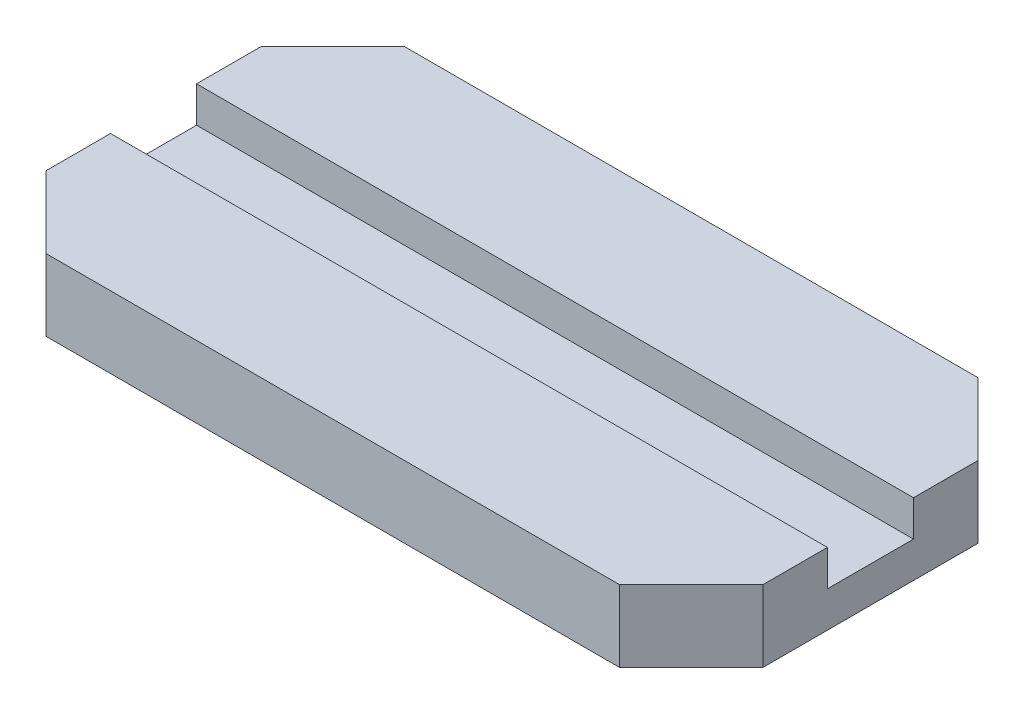
ISO-10303-21;
HEADER;
FILE_DESCRIPTION(('STEP AP214'),'2;1');
FILE_NAME('part.step','',(''),(''),'','','');
FILE_SCHEMA(('AUTOMOTIVE_DESIGN { 1 0 10303 214 1 1 1 1 }'));
ENDSEC;
DATA;
#1=APPLICATION_CONTEXT('core data for automotive mechanical design processes');
#2=APPLICATION_PROTOCOL_DEFINITION('international standard','automotive_design',2000,#1);
#3=PRODUCT_CONTEXT('',#1,'mechanical');
#4=PRODUCT('Part','Part','',(#3));
#5=PRODUCT_RELATED_PRODUCT_CATEGORY('part','',(#4));
#6=PRODUCT_DEFINITION_FORMATION('','',#4);
#7=PRODUCT_DEFINITION_CONTEXT('part definition',#1,'design');
#8=PRODUCT_DEFINITION('design','',#6,#7);
#9=PRODUCT_DEFINITION_SHAPE('','',#8);
#10=(LENGTH_UNIT() NAMED_UNIT(*) SI_UNIT(.MILLI.,.METRE.));
#11=(NAMED_UNIT(*) PLANE_ANGLE_UNIT() SI_UNIT($,.RADIAN.));
#12=(NAMED_UNIT(*) SI_UNIT($,.STERADIAN.) SOLID_ANGLE_UNIT());
#13=UNCERTAINTY_MEASURE_WITH_UNIT(LENGTH_MEASURE(1.E-05),#10,'distance_accuracy_value','');
#14=(GEOMETRIC_REPRESENTATION_CONTEXT(3) GLOBAL_UNCERTAINTY_ASSIGNED_CONTEXT((#13)) GLOBAL_UNIT_ASSIGNED_CONTEXT((#10,
#11,#12)) REPRESENTATION_CONTEXT('',''));
#15=CARTESIAN_POINT('',(0.,0.,0.));
#16=DIRECTION('',(0.,0.,1.));
#17=DIRECTION('',(1.,0.,0.));
#18=AXIS2_PLACEMENT_3D('',#15,#16,#17);
#19=CARTESIAN_POINT('',(0.,10.,0.));
#20=DIRECTION('',(0.,1.,0.));
#21=DIRECTION('',(0.,0.,1.));
#22=AXIS2_PLACEMENT_3D('',#19,#20,#21);
#23=PLANE('',#22);
#24=DIRECTION('',(-1.,0.,0.));
#25=VECTOR('',#24,1.);
#26=CARTESIAN_POINT('',(0.,10.,-6.));
#27=LINE('',#26,#25);
#28=CARTESIAN_POINT('',(50.,10.,-6.));
#29=VERTEX_POINT('',#28);
#30=CARTESIAN_POINT('',(-50.,10.,-6.));
#31=VERTEX_POINT('',#30);
#32=EDGE_CURVE('E54',#29,#31,#27,.T.);
#33=ORIENTED_EDGE('',*,*,#32,.F.);
#34=DIRECTION('',(0.,0.,-1.));
#35=VECTOR('',#34,1.);
#36=CARTESIAN_POINT('',(50.,10.,-25.));
#37=LINE('',#36,#35);
#38=CARTESIAN_POINT('',(50.,10.,-15.));
#39=VERTEX_POINT('',#38);
#40=EDGE_CURVE('E69',#29,#39,#37,.T.);
#41=ORIENTED_EDGE('',*,*,#40,.T.);
#42=DIRECTION('',(0.707106781186547,0.,0.707106781186549));
#43=VECTOR('',#42,1.);
#44=CARTESIAN_POINT('',(32.5,10.,-32.5));
#45=LINE('',#44,#43);
#46=CARTESIAN_POINT('',(40.,10.,-25.));
#47=VERTEX_POINT('',#46);
#48=EDGE_CURVE('E199',#39,#47,#45,.F.);
#49=ORIENTED_EDGE('',*,*,#48,.T.);
#50=DIRECTION('',(-1.,0.,0.));
#51=VECTOR('',#50,1.);
#52=CARTESIAN_POINT('',(-50.,10.,-25.));
#53=LINE('',#52,#51);
#54=CARTESIAN_POINT('',(-40.,10.,-25.));
#55=VERTEX_POINT('',#54);
#56=EDGE_CURVE('E157',#47,#55,#53,.T.);
#57=ORIENTED_EDGE('',*,*,#56,.T.);
#58=DIRECTION('',(0.707106781186549,0.,-0.707106781186547));
#59=VECTOR('',#58,1.);
#60=CARTESIAN_POINT('',(-32.4999999999999,10.,-32.5));
#61=LINE('',#60,#59);
#62=CARTESIAN_POINT('',(-50.,10.,-15.));
#63=VERTEX_POINT('',#62);
#64=EDGE_CURVE('E203',#55,#63,#61,.F.);
#65=ORIENTED_EDGE('',*,*,#64,.T.);
#66=DIRECTION('',(0.,0.,1.));
#67=VECTOR('',#66,1.);
#68=CARTESIAN_POINT('',(-50.,10.,-25.));
#69=LINE('',#68,#67);
#70=EDGE_CURVE('E224',#63,#31,#69,.T.);
#71=ORIENTED_EDGE('',*,*,#70,.T.);
#72=EDGE_LOOP('',(#33,#41,#49,#57,#65,#71));
#73=FACE_BOUND('',#72,.T.);
#74=ADVANCED_FACE('F45',(#73),#23,.T.);
#75=CARTESIAN_POINT('',(-50.,10.,-25.));
#76=DIRECTION('',(1.,0.,0.));
#77=DIRECTION('',(0.,0.,-1.));
#78=AXIS2_PLACEMENT_3D('',#75,#76,#77);
#79=PLANE('',#78);
#80=DIRECTION('',(0.,0.,1.));
#81=VECTOR('',#80,1.);
#82=CARTESIAN_POINT('',(-50.,5.,-25.));
#83=LINE('',#82,#81);
#84=CARTESIAN_POINT('',(-50.,5.,-6.));
#85=VERTEX_POINT('',#84);
#86=CARTESIAN_POINT('',(-50.,5.,6.));
#87=VERTEX_POINT('',#86);
#88=EDGE_CURVE('E170',#85,#87,#83,.T.);
#89=ORIENTED_EDGE('',*,*,#88,.F.);
#90=DIRECTION('',(0.,1.,0.));
#91=VECTOR('',#90,1.);
#92=CARTESIAN_POINT('',(-50.,10.,-6.));
#93=LINE('',#92,#91);
#94=EDGE_CURVE('E216',#85,#31,#93,.T.);
#95=ORIENTED_EDGE('',*,*,#94,.T.);
#96=ORIENTED_EDGE('',*,*,#70,.F.);
#97=DIRECTION('',(0.,-1.,0.));
#98=VECTOR('',#97,1.);
#99=CARTESIAN_POINT('',(-50.,10.,-15.));
#100=LINE('',#99,#98);
#101=CARTESIAN_POINT('',(-50.,0.,-15.));
#102=VERTEX_POINT('',#101);
#103=EDGE_CURVE('E182',#63,#102,#100,.T.);
#104=ORIENTED_EDGE('',*,*,#103,.T.);
#105=DIRECTION('',(0.,0.,1.));
#106=VECTOR('',#105,1.);
#107=CARTESIAN_POINT('',(-50.,0.,-25.));
#108=LINE('',#107,#106);
#109=CARTESIAN_POINT('',(-50.,0.,15.));
#110=VERTEX_POINT('',#109);
#111=EDGE_CURVE('E166',#102,#110,#108,.T.);
#112=ORIENTED_EDGE('',*,*,#111,.T.);
#113=DIRECTION('',(0.,1.,0.));
#114=VECTOR('',#113,1.);
#115=CARTESIAN_POINT('',(-50.,10.,15.));
#116=LINE('',#115,#114);
#117=CARTESIAN_POINT('',(-50.,10.,15.));
#118=VERTEX_POINT('',#117);
#119=EDGE_CURVE('E160',#110,#118,#116,.T.);
#120=ORIENTED_EDGE('',*,*,#119,.T.);
#121=CARTESIAN_POINT('',(-50.,10.,6.));
#122=VERTEX_POINT('',#121);
#123=EDGE_CURVE('E179',#122,#118,#69,.T.);
#124=ORIENTED_EDGE('',*,*,#123,.F.);
#125=DIRECTION('',(0.,-1.,0.));
#126=VECTOR('',#125,1.);
#127=CARTESIAN_POINT('',(-50.,10.,6.));
#128=LINE('',#127,#126);
#129=EDGE_CURVE('E61',#122,#87,#128,.T.);
#130=ORIENTED_EDGE('',*,*,#129,.T.);
#131=EDGE_LOOP('',(#89,#95,#96,#104,#112,#120,#124,#130));
#132=FACE_BOUND('',#131,.T.);
#133=ADVANCED_FACE('F223',(#132),#79,.F.);
#134=CARTESIAN_POINT('',(-50.,10.,25.));
#135=DIRECTION('',(0.,0.,-1.));
#136=DIRECTION('',(-1.,0.,0.));
#137=AXIS2_PLACEMENT_3D('',#134,#135,#136);
#138=PLANE('',#137);
#139=DIRECTION('',(1.,0.,0.));
#140=VECTOR('',#139,1.);
#141=CARTESIAN_POINT('',(-50.,10.,25.));
#142=LINE('',#141,#140);
#143=CARTESIAN_POINT('',(-40.,10.,25.));
#144=VERTEX_POINT('',#143);
#145=CARTESIAN_POINT('',(39.9999999999999,10.,25.));
#146=VERTEX_POINT('',#145);
#147=EDGE_CURVE('E162',#144,#146,#142,.T.);
#148=ORIENTED_EDGE('',*,*,#147,.F.);
#149=DIRECTION('',(0.,-1.,0.));
#150=VECTOR('',#149,1.);
#151=CARTESIAN_POINT('',(-40.,10.,25.));
#152=LINE('',#151,#150);
#153=CARTESIAN_POINT('',(-40.,0.,25.));
#154=VERTEX_POINT('',#153);
#155=EDGE_CURVE('E207',#144,#154,#152,.T.);
#156=ORIENTED_EDGE('',*,*,#155,.T.);
#157=DIRECTION('',(1.,0.,0.));
#158=VECTOR('',#157,1.);
#159=CARTESIAN_POINT('',(-50.,0.,25.));
#160=LINE('',#159,#158);
#161=CARTESIAN_POINT('',(39.9999999999999,0.,25.));
#162=VERTEX_POINT('',#161);
#163=EDGE_CURVE('E169',#154,#162,#160,.T.);
#164=ORIENTED_EDGE('',*,*,#163,.T.);
#165=DIRECTION('',(0.,1.,0.));
#166=VECTOR('',#165,1.);
#167=CARTESIAN_POINT('',(39.9999999999999,10.,25.));
#168=LINE('',#167,#166);
#169=EDGE_CURVE('E205',#162,#146,#168,.T.);
#170=ORIENTED_EDGE('',*,*,#169,.T.);
#171=EDGE_LOOP('',(#148,#156,#164,#170));
#172=FACE_BOUND('',#171,.T.);
#173=ADVANCED_FACE('F242',(#172),#138,.F.);
#174=CARTESIAN_POINT('',(50.,10.,-25.));
#175=DIRECTION('',(-1.,0.,0.));
#176=DIRECTION('',(0.,0.,1.));
#177=AXIS2_PLACEMENT_3D('',#174,#175,#176);
#178=PLANE('',#177);
#179=ORIENTED_EDGE('',*,*,#40,.F.);
#180=DIRECTION('',(0.,-1.,0.));
#181=VECTOR('',#180,1.);
#182=CARTESIAN_POINT('',(50.,10.,-6.));
#183=LINE('',#182,#181);
#184=CARTESIAN_POINT('',(50.,5.,-6.));
#185=VERTEX_POINT('',#184);
#186=EDGE_CURVE('E218',#29,#185,#183,.T.);
#187=ORIENTED_EDGE('',*,*,#186,.T.);
#188=DIRECTION('',(0.,0.,-1.));
#189=VECTOR('',#188,1.);
#190=CARTESIAN_POINT('',(50.,5.,-25.));
#191=LINE('',#190,#189);
#192=CARTESIAN_POINT('',(50.,5.,6.));
#193=VERTEX_POINT('',#192);
#194=EDGE_CURVE('E11',#193,#185,#191,.T.);
#195=ORIENTED_EDGE('',*,*,#194,.F.);
#196=DIRECTION('',(0.,1.,0.));
#197=VECTOR('',#196,1.);
#198=CARTESIAN_POINT('',(50.,10.,6.));
#199=LINE('',#198,#197);
#200=CARTESIAN_POINT('',(50.,10.,6.));
#201=VERTEX_POINT('',#200);
#202=EDGE_CURVE('E136',#193,#201,#199,.T.);
#203=ORIENTED_EDGE('',*,*,#202,.T.);
#204=CARTESIAN_POINT('',(50.,10.,15.));
#205=VERTEX_POINT('',#204);
#206=EDGE_CURVE('E148',#205,#201,#37,.T.);
#207=ORIENTED_EDGE('',*,*,#206,.F.);
#208=DIRECTION('',(0.,-1.,0.));
#209=VECTOR('',#208,1.);
#210=CARTESIAN_POINT('',(50.,10.,15.));
#211=LINE('',#210,#209);
#212=CARTESIAN_POINT('',(50.,0.,15.));
#213=VERTEX_POINT('',#212);
#214=EDGE_CURVE('E210',#205,#213,#211,.T.);
#215=ORIENTED_EDGE('',*,*,#214,.T.);
#216=DIRECTION('',(0.,0.,-1.));
#217=VECTOR('',#216,1.);
#218=CARTESIAN_POINT('',(50.,0.,-25.));
#219=LINE('',#218,#217);
#220=CARTESIAN_POINT('',(50.,0.,-15.));
#221=VERTEX_POINT('',#220);
#222=EDGE_CURVE('E173',#213,#221,#219,.T.);
#223=ORIENTED_EDGE('',*,*,#222,.T.);
#224=DIRECTION('',(0.,1.,0.));
#225=VECTOR('',#224,1.);
#226=CARTESIAN_POINT('',(50.,10.,-15.));
#227=LINE('',#226,#225);
#228=EDGE_CURVE('E141',#221,#39,#227,.T.);
#229=ORIENTED_EDGE('',*,*,#228,.T.);
#230=EDGE_LOOP('',(#179,#187,#195,#203,#207,#215,#223,#229));
#231=FACE_BOUND('',#230,.T.);
#232=ADVANCED_FACE('F146',(#231),#178,.F.);
#233=CARTESIAN_POINT('',(-50.,10.,-25.));
#234=DIRECTION('',(0.,0.,1.));
#235=DIRECTION('',(1.,0.,0.));
#236=AXIS2_PLACEMENT_3D('',#233,#234,#235);
#237=PLANE('',#236);
#238=DIRECTION('',(-1.,0.,0.));
#239=VECTOR('',#238,1.);
#240=CARTESIAN_POINT('',(-50.,0.,-25.));
#241=LINE('',#240,#239);
#242=CARTESIAN_POINT('',(40.,0.,-25.));
#243=VERTEX_POINT('',#242);
#244=CARTESIAN_POINT('',(-40.,0.,-25.));
#245=VERTEX_POINT('',#244);
#246=EDGE_CURVE('E176',#243,#245,#241,.T.);
#247=ORIENTED_EDGE('',*,*,#246,.T.);
#248=DIRECTION('',(0.,1.,0.));
#249=VECTOR('',#248,1.);
#250=CARTESIAN_POINT('',(-40.,10.,-25.));
#251=LINE('',#250,#249);
#252=EDGE_CURVE('E196',#245,#55,#251,.T.);
#253=ORIENTED_EDGE('',*,*,#252,.T.);
#254=ORIENTED_EDGE('',*,*,#56,.F.);
#255=DIRECTION('',(0.,-1.,0.));
#256=VECTOR('',#255,1.);
#257=CARTESIAN_POINT('',(40.,10.,-25.));
#258=LINE('',#257,#256);
#259=EDGE_CURVE('E193',#47,#243,#258,.T.);
#260=ORIENTED_EDGE('',*,*,#259,.T.);
#261=EDGE_LOOP('',(#247,#253,#254,#260));
#262=FACE_BOUND('',#261,.T.);
#263=ADVANCED_FACE('F254',(#262),#237,.F.);
#264=DIRECTION('',(1.,0.,0.));
#265=VECTOR('',#264,1.);
#266=CARTESIAN_POINT('',(0.,10.,6.));
#267=LINE('',#266,#265);
#268=EDGE_CURVE('E133',#122,#201,#267,.T.);
#269=ORIENTED_EDGE('',*,*,#268,.F.);
#270=ORIENTED_EDGE('',*,*,#123,.T.);
#271=DIRECTION('',(-0.707106781186546,0.,-0.707106781186549));
#272=VECTOR('',#271,1.);
#273=CARTESIAN_POINT('',(-32.5000000000001,10.,32.5));
#274=LINE('',#273,#272);
#275=EDGE_CURVE('E201',#118,#144,#274,.F.);
#276=ORIENTED_EDGE('',*,*,#275,.T.);
#277=ORIENTED_EDGE('',*,*,#147,.T.);
#278=DIRECTION('',(-0.707106781186549,0.,0.707106781186546));
#279=VECTOR('',#278,1.);
#280=CARTESIAN_POINT('',(32.4999999999999,10.,32.5));
#281=LINE('',#280,#279);
#282=EDGE_CURVE('E156',#146,#205,#281,.F.);
#283=ORIENTED_EDGE('',*,*,#282,.T.);
#284=ORIENTED_EDGE('',*,*,#206,.T.);
#285=EDGE_LOOP('',(#269,#270,#276,#277,#283,#284));
#286=FACE_BOUND('',#285,.T.);
#287=ADVANCED_FACE('F153',(#286),#23,.T.);
#288=CARTESIAN_POINT('',(0.,0.,0.));
#289=DIRECTION('',(0.,1.,0.));
#290=DIRECTION('',(0.,0.,1.));
#291=AXIS2_PLACEMENT_3D('',#288,#289,#290);
#292=PLANE('',#291);
#293=ORIENTED_EDGE('',*,*,#111,.F.);
#294=DIRECTION('',(-0.707106781186549,0.,0.707106781186547));
#295=VECTOR('',#294,1.);
#296=CARTESIAN_POINT('',(-50.,0.,-15.));
#297=LINE('',#296,#295);
#298=EDGE_CURVE('E191',#102,#245,#297,.F.);
#299=ORIENTED_EDGE('',*,*,#298,.T.);
#300=ORIENTED_EDGE('',*,*,#246,.F.);
#301=DIRECTION('',(-0.707106781186547,0.,-0.707106781186549));
#302=VECTOR('',#301,1.);
#303=CARTESIAN_POINT('',(40.,0.,-25.));
#304=LINE('',#303,#302);
#305=EDGE_CURVE('E187',#243,#221,#304,.F.);
#306=ORIENTED_EDGE('',*,*,#305,.T.);
#307=ORIENTED_EDGE('',*,*,#222,.F.);
#308=DIRECTION('',(0.707106781186549,0.,-0.707106781186546));
#309=VECTOR('',#308,1.);
#310=CARTESIAN_POINT('',(50.,0.,15.));
#311=LINE('',#310,#309);
#312=EDGE_CURVE('E185',#213,#162,#311,.F.);
#313=ORIENTED_EDGE('',*,*,#312,.T.);
#314=ORIENTED_EDGE('',*,*,#163,.F.);
#315=DIRECTION('',(0.707106781186546,0.,0.707106781186549));
#316=VECTOR('',#315,1.);
#317=CARTESIAN_POINT('',(-40.,0.,25.));
#318=LINE('',#317,#316);
#319=EDGE_CURVE('E189',#154,#110,#318,.F.);
#320=ORIENTED_EDGE('',*,*,#319,.T.);
#321=EDGE_LOOP('',(#293,#299,#300,#306,#307,#313,#314,#320));
#322=FACE_BOUND('',#321,.T.);
#323=ADVANCED_FACE('F248',(#322),#292,.F.);
#324=CARTESIAN_POINT('',(-50.,10.,-15.));
#325=DIRECTION('',(0.707106781186547,0.,0.707106781186549));
#326=DIRECTION('',(0.,-1.,0.));
#327=AXIS2_PLACEMENT_3D('',#324,#325,#326);
#328=PLANE('',#327);
#329=ORIENTED_EDGE('',*,*,#64,.F.);
#330=ORIENTED_EDGE('',*,*,#252,.F.);
#331=ORIENTED_EDGE('',*,*,#298,.F.);
#332=ORIENTED_EDGE('',*,*,#103,.F.);
#333=EDGE_LOOP('',(#329,#330,#331,#332));
#334=FACE_BOUND('',#333,.T.);
#335=ADVANCED_FACE('F250',(#334),#328,.F.);
#336=CARTESIAN_POINT('',(-40.,10.,25.));
#337=DIRECTION('',(0.707106781186549,0.,-0.707106781186546));
#338=DIRECTION('',(0.,-1.,0.));
#339=AXIS2_PLACEMENT_3D('',#336,#337,#338);
#340=PLANE('',#339);
#341=ORIENTED_EDGE('',*,*,#275,.F.);
#342=ORIENTED_EDGE('',*,*,#119,.F.);
#343=ORIENTED_EDGE('',*,*,#319,.F.);
#344=ORIENTED_EDGE('',*,*,#155,.F.);
#345=EDGE_LOOP('',(#341,#342,#343,#344));
#346=FACE_BOUND('',#345,.T.);
#347=ADVANCED_FACE('F245',(#346),#340,.F.);
#348=CARTESIAN_POINT('',(40.,10.,-25.));
#349=DIRECTION('',(-0.707106781186549,0.,0.707106781186547));
#350=DIRECTION('',(0.,-1.,0.));
#351=AXIS2_PLACEMENT_3D('',#348,#349,#350);
#352=PLANE('',#351);
#353=ORIENTED_EDGE('',*,*,#48,.F.);
#354=ORIENTED_EDGE('',*,*,#228,.F.);
#355=ORIENTED_EDGE('',*,*,#305,.F.);
#356=ORIENTED_EDGE('',*,*,#259,.F.);
#357=EDGE_LOOP('',(#353,#354,#355,#356));
#358=FACE_BOUND('',#357,.T.);
#359=ADVANCED_FACE('F259',(#358),#352,.F.);
#360=CARTESIAN_POINT('',(50.,10.,15.));
#361=DIRECTION('',(-0.707106781186546,0.,-0.707106781186549));
#362=DIRECTION('',(0.,-1.,0.));
#363=AXIS2_PLACEMENT_3D('',#360,#361,#362);
#364=PLANE('',#363);
#365=ORIENTED_EDGE('',*,*,#282,.F.);
#366=ORIENTED_EDGE('',*,*,#169,.F.);
#367=ORIENTED_EDGE('',*,*,#312,.F.);
#368=ORIENTED_EDGE('',*,*,#214,.F.);
#369=EDGE_LOOP('',(#365,#366,#367,#368));
#370=FACE_BOUND('',#369,.T.);
#371=ADVANCED_FACE('F48',(#370),#364,.F.);
#372=CARTESIAN_POINT('',(0.,5.,0.));
#373=DIRECTION('',(0.,1.,0.));
#374=DIRECTION('',(0.,0.,1.));
#375=AXIS2_PLACEMENT_3D('',#372,#373,#374);
#376=PLANE('',#375);
#377=ORIENTED_EDGE('',*,*,#88,.T.);
#378=DIRECTION('',(1.,0.,0.));
#379=VECTOR('',#378,1.);
#380=CARTESIAN_POINT('',(-58.3808225040527,5.,6.));
#381=LINE('',#380,#379);
#382=EDGE_CURVE('E233',#87,#193,#381,.T.);
#383=ORIENTED_EDGE('',*,*,#382,.T.);
#384=ORIENTED_EDGE('',*,*,#194,.T.);
#385=DIRECTION('',(-1.,0.,0.));
#386=VECTOR('',#385,1.);
#387=CARTESIAN_POINT('',(-58.3808225040527,5.,-6.));
#388=LINE('',#387,#386);
#389=EDGE_CURVE('E151',#185,#85,#388,.T.);
#390=ORIENTED_EDGE('',*,*,#389,.T.);
#391=EDGE_LOOP('',(#377,#383,#384,#390));
#392=FACE_BOUND('',#391,.T.);
#393=ADVANCED_FACE('F235',(#392),#376,.T.);
#394=CARTESIAN_POINT('',(-58.3808225040527,5.,-6.));
#395=DIRECTION('',(0.,0.,-1.));
#396=DIRECTION('',(-1.,0.,0.));
#397=AXIS2_PLACEMENT_3D('',#394,#395,#396);
#398=PLANE('',#397);
#399=ORIENTED_EDGE('',*,*,#389,.F.);
#400=ORIENTED_EDGE('',*,*,#186,.F.);
#401=ORIENTED_EDGE('',*,*,#32,.T.);
#402=ORIENTED_EDGE('',*,*,#94,.F.);
#403=EDGE_LOOP('',(#399,#400,#401,#402));
#404=FACE_BOUND('',#403,.T.);
#405=ADVANCED_FACE('F215',(#404),#398,.F.);
#406=CARTESIAN_POINT('',(-58.3808225040527,5.,6.));
#407=DIRECTION('',(0.,0.,1.));
#408=DIRECTION('',(1.,0.,0.));
#409=AXIS2_PLACEMENT_3D('',#406,#407,#408);
#410=PLANE('',#409);
#411=ORIENTED_EDGE('',*,*,#268,.T.);
#412=ORIENTED_EDGE('',*,*,#202,.F.);
#413=ORIENTED_EDGE('',*,*,#382,.F.);
#414=ORIENTED_EDGE('',*,*,#129,.F.);
#415=EDGE_LOOP('',(#411,#412,#413,#414));
#416=FACE_BOUND('',#415,.T.);
#417=ADVANCED_FACE('F135',(#416),#410,.F.);
#418=CLOSED_SHELL('',(#74,#133,#173,#232,#263,#287,#323,#335,#347,#359,#371,#393,#405,#417));
#419=MANIFOLD_SOLID_BREP('B2',#418);
#420=ADVANCED_BREP_SHAPE_REPRESENTATION('',(#18,#419),#14);
#421=SHAPE_DEFINITION_REPRESENTATION(#9,#420);
ENDSEC;
END-ISO-10303-21;
